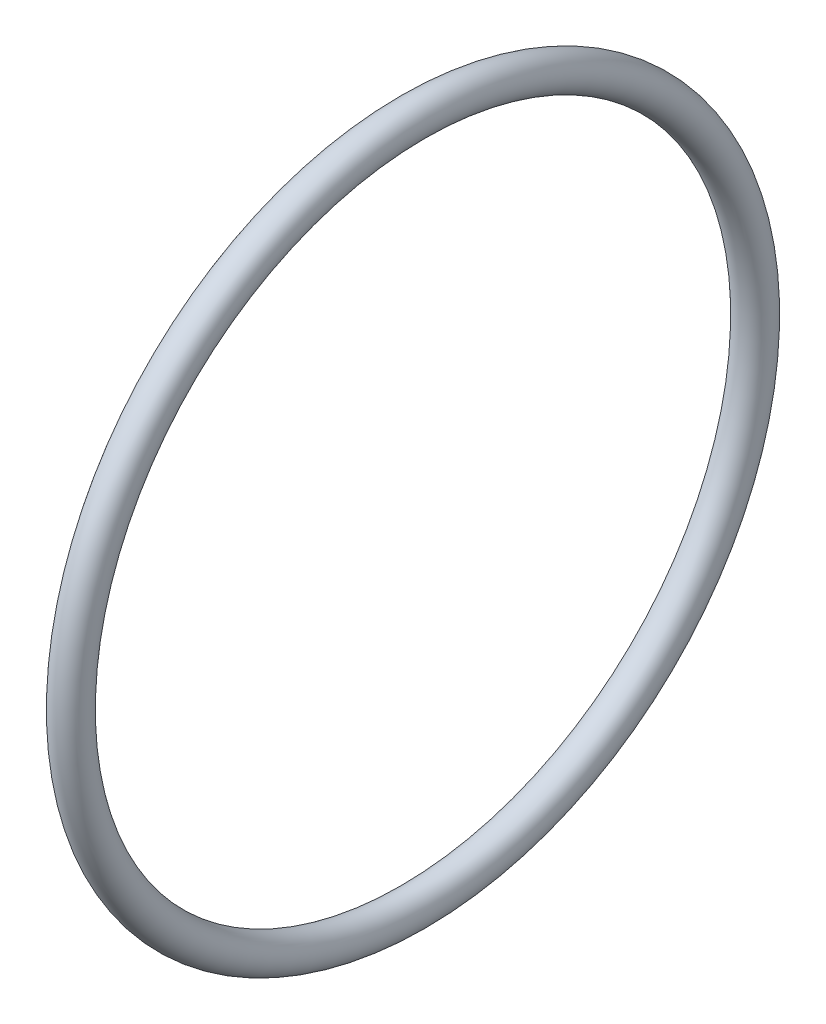
ISO-10303-21;
HEADER;
FILE_DESCRIPTION(('STEP AP214'),'2;1');
FILE_NAME('part.step','',(''),(''),'','','');
FILE_SCHEMA(('AUTOMOTIVE_DESIGN { 1 0 10303 214 1 1 1 1 }'));
ENDSEC;
DATA;
#1=APPLICATION_CONTEXT('core data for automotive mechanical design processes');
#2=APPLICATION_PROTOCOL_DEFINITION('international standard','automotive_design',2000,#1);
#3=PRODUCT_CONTEXT('',#1,'mechanical');
#4=PRODUCT('Part','Part','',(#3));
#5=PRODUCT_RELATED_PRODUCT_CATEGORY('part','',(#4));
#6=PRODUCT_DEFINITION_FORMATION('','',#4);
#7=PRODUCT_DEFINITION_CONTEXT('part definition',#1,'design');
#8=PRODUCT_DEFINITION('design','',#6,#7);
#9=PRODUCT_DEFINITION_SHAPE('','',#8);
#10=(LENGTH_UNIT() NAMED_UNIT(*) SI_UNIT(.MILLI.,.METRE.));
#11=(NAMED_UNIT(*) PLANE_ANGLE_UNIT() SI_UNIT($,.RADIAN.));
#12=(NAMED_UNIT(*) SI_UNIT($,.STERADIAN.) SOLID_ANGLE_UNIT());
#13=UNCERTAINTY_MEASURE_WITH_UNIT(LENGTH_MEASURE(1.E-05),#10,'distance_accuracy_value','');
#14=(GEOMETRIC_REPRESENTATION_CONTEXT(3) GLOBAL_UNCERTAINTY_ASSIGNED_CONTEXT((#13)) GLOBAL_UNIT_ASSIGNED_CONTEXT((#10,
#11,#12)) REPRESENTATION_CONTEXT('',''));
#15=CARTESIAN_POINT('',(0.,0.,0.));
#16=DIRECTION('',(0.,0.,1.));
#17=DIRECTION('',(1.,0.,0.));
#18=AXIS2_PLACEMENT_3D('',#15,#16,#17);
#19=CARTESIAN_POINT('',(-16.5099999999998,1432.78731013692,0.));
#20=DIRECTION('',(-1.,0.,0.));
#21=DIRECTION('',(0.,-1.,0.));
#22=AXIS2_PLACEMENT_3D('',#19,#20,#21);
#23=TOROIDAL_SURFACE('',#22,12.5476000000001,0.63499999999993);
#24=CARTESIAN_POINT('',(-16.5099999999996,1419.60471013692,0.));
#25=VERTEX_POINT('',#24);
#26=VERTEX_LOOP('',#25);
#27=FACE_BOUND('',#26,.T.);
#28=ADVANCED_FACE('F30',(#27),#23,.T.);
#29=CLOSED_SHELL('',(#28));
#30=MANIFOLD_SOLID_BREP('B2',#29);
#31=ADVANCED_BREP_SHAPE_REPRESENTATION('',(#18,#30),#14);
#32=SHAPE_DEFINITION_REPRESENTATION(#9,#31);
ENDSEC;
END-ISO-10303-21;
